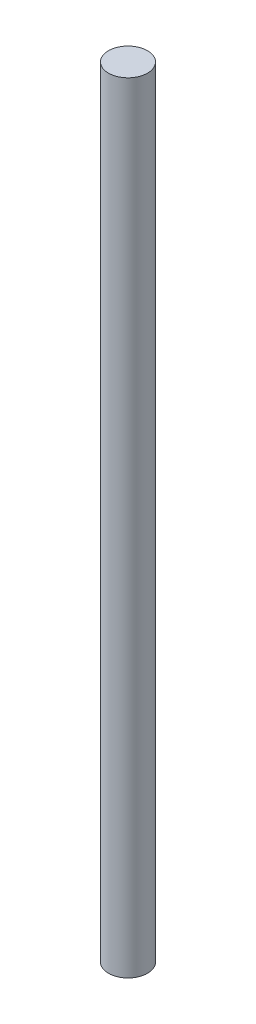
ISO-10303-21;
HEADER;
FILE_DESCRIPTION(('STEP AP214'),'2;1');
FILE_NAME('part.step','',(''),(''),'','','');
FILE_SCHEMA(('AUTOMOTIVE_DESIGN { 1 0 10303 214 1 1 1 1 }'));
ENDSEC;
DATA;
#1=APPLICATION_CONTEXT('core data for automotive mechanical design processes');
#2=APPLICATION_PROTOCOL_DEFINITION('international standard','automotive_design',2000,#1);
#3=PRODUCT_CONTEXT('',#1,'mechanical');
#4=PRODUCT('Part','Part','',(#3));
#5=PRODUCT_RELATED_PRODUCT_CATEGORY('part','',(#4));
#6=PRODUCT_DEFINITION_FORMATION('','',#4);
#7=PRODUCT_DEFINITION_CONTEXT('part definition',#1,'design');
#8=PRODUCT_DEFINITION('design','',#6,#7);
#9=PRODUCT_DEFINITION_SHAPE('','',#8);
#10=(LENGTH_UNIT() NAMED_UNIT(*) SI_UNIT(.MILLI.,.METRE.));
#11=(NAMED_UNIT(*) PLANE_ANGLE_UNIT() SI_UNIT($,.RADIAN.));
#12=(NAMED_UNIT(*) SI_UNIT($,.STERADIAN.) SOLID_ANGLE_UNIT());
#13=UNCERTAINTY_MEASURE_WITH_UNIT(LENGTH_MEASURE(1.E-05),#10,'distance_accuracy_value','');
#14=(GEOMETRIC_REPRESENTATION_CONTEXT(3) GLOBAL_UNCERTAINTY_ASSIGNED_CONTEXT((#13)) GLOBAL_UNIT_ASSIGNED_CONTEXT((#10,
#11,#12)) REPRESENTATION_CONTEXT('',''));
#15=CARTESIAN_POINT('',(0.,0.,0.));
#16=DIRECTION('',(0.,0.,1.));
#17=DIRECTION('',(1.,0.,0.));
#18=AXIS2_PLACEMENT_3D('',#15,#16,#17);
#19=CARTESIAN_POINT('',(0.,63.5,0.));
#20=DIRECTION('',(0.,-1.,0.));
#21=DIRECTION('',(0.,0.,-1.));
#22=AXIS2_PLACEMENT_3D('',#19,#20,#21);
#23=CYLINDRICAL_SURFACE('',#22,3.175);
#24=CARTESIAN_POINT('',(0.,63.5,0.));
#25=DIRECTION('',(0.,1.,0.));
#26=DIRECTION('',(0.,0.,1.));
#27=AXIS2_PLACEMENT_3D('',#24,#25,#26);
#28=CIRCLE('',#27,3.175);
#29=CARTESIAN_POINT('',(0.,63.5,3.175));
#30=VERTEX_POINT('',#29);
#31=EDGE_CURVE('E10',#30,#30,#28,.T.);
#32=ORIENTED_EDGE('',*,*,#31,.F.);
#33=EDGE_LOOP('',(#32));
#34=FACE_BOUND('',#33,.T.);
#35=CARTESIAN_POINT('',(0.,-63.5,0.));
#36=DIRECTION('',(0.,1.,0.));
#37=DIRECTION('',(0.,0.,1.));
#38=AXIS2_PLACEMENT_3D('',#35,#36,#37);
#39=CIRCLE('',#38,3.175);
#40=CARTESIAN_POINT('',(0.,-63.5,3.175));
#41=VERTEX_POINT('',#40);
#42=EDGE_CURVE('E46',#41,#41,#39,.T.);
#43=ORIENTED_EDGE('',*,*,#42,.T.);
#44=EDGE_LOOP('',(#43));
#45=FACE_BOUND('',#44,.T.);
#46=ADVANCED_FACE('F43',(#34,#45),#23,.T.);
#47=CARTESIAN_POINT('',(0.,63.5,0.));
#48=DIRECTION('',(0.,1.,0.));
#49=DIRECTION('',(0.,0.,1.));
#50=AXIS2_PLACEMENT_3D('',#47,#48,#49);
#51=PLANE('',#50);
#52=ORIENTED_EDGE('',*,*,#31,.T.);
#53=EDGE_LOOP('',(#52));
#54=FACE_BOUND('',#53,.T.);
#55=ADVANCED_FACE('F60',(#54),#51,.T.);
#56=CARTESIAN_POINT('',(0.,-63.5,0.));
#57=DIRECTION('',(0.,1.,0.));
#58=DIRECTION('',(0.,0.,1.));
#59=AXIS2_PLACEMENT_3D('',#56,#57,#58);
#60=PLANE('',#59);
#61=ORIENTED_EDGE('',*,*,#42,.F.);
#62=EDGE_LOOP('',(#61));
#63=FACE_BOUND('',#62,.T.);
#64=ADVANCED_FACE('F58',(#63),#60,.F.);
#65=CLOSED_SHELL('',(#46,#55,#64));
#66=MANIFOLD_SOLID_BREP('B2',#65);
#67=ADVANCED_BREP_SHAPE_REPRESENTATION('',(#18,#66),#14);
#68=SHAPE_DEFINITION_REPRESENTATION(#9,#67);
ENDSEC;
END-ISO-10303-21;
